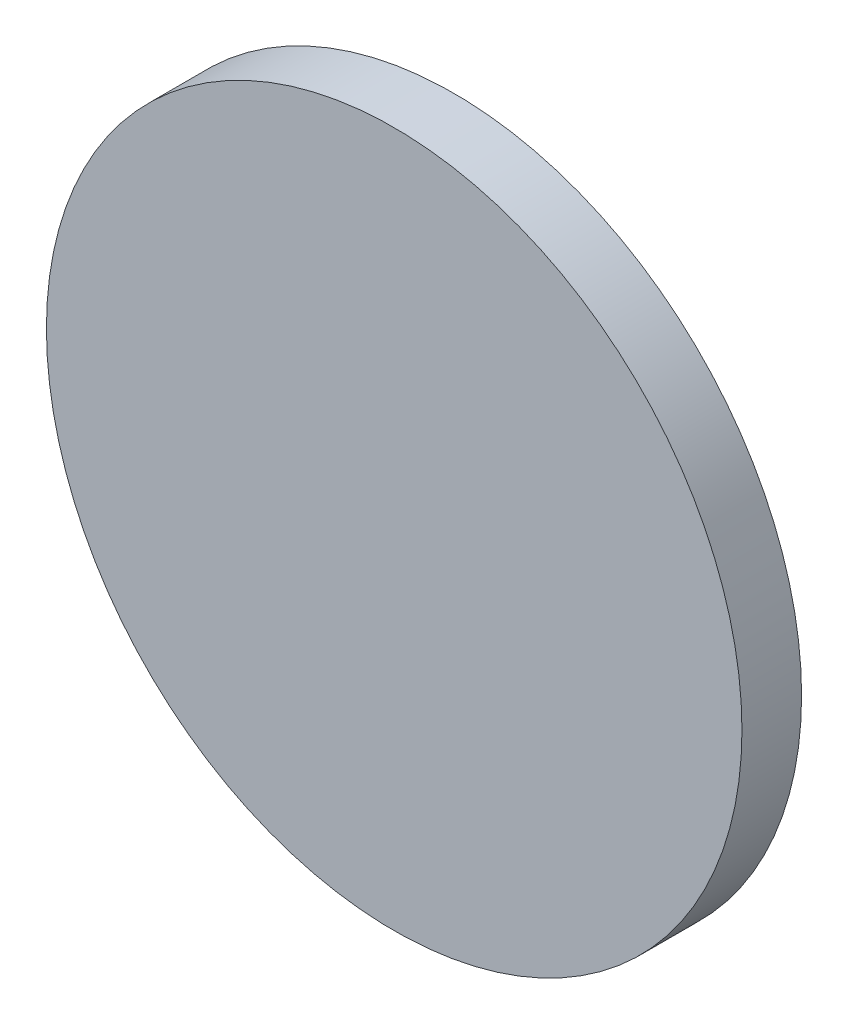
ISO-10303-21;
HEADER;
FILE_DESCRIPTION(('STEP AP214'),'2;1');
FILE_NAME('part.step','',(''),(''),'','','');
FILE_SCHEMA(('AUTOMOTIVE_DESIGN { 1 0 10303 214 1 1 1 1 }'));
ENDSEC;
DATA;
#1=APPLICATION_CONTEXT('core data for automotive mechanical design processes');
#2=APPLICATION_PROTOCOL_DEFINITION('international standard','automotive_design',2000,#1);
#3=PRODUCT_CONTEXT('',#1,'mechanical');
#4=PRODUCT('Part','Part','',(#3));
#5=PRODUCT_RELATED_PRODUCT_CATEGORY('part','',(#4));
#6=PRODUCT_DEFINITION_FORMATION('','',#4);
#7=PRODUCT_DEFINITION_CONTEXT('part definition',#1,'design');
#8=PRODUCT_DEFINITION('design','',#6,#7);
#9=PRODUCT_DEFINITION_SHAPE('','',#8);
#10=(LENGTH_UNIT() NAMED_UNIT(*) SI_UNIT(.MILLI.,.METRE.));
#11=(NAMED_UNIT(*) PLANE_ANGLE_UNIT() SI_UNIT($,.RADIAN.));
#12=(NAMED_UNIT(*) SI_UNIT($,.STERADIAN.) SOLID_ANGLE_UNIT());
#13=UNCERTAINTY_MEASURE_WITH_UNIT(LENGTH_MEASURE(1.E-05),#10,'distance_accuracy_value','');
#14=(GEOMETRIC_REPRESENTATION_CONTEXT(3) GLOBAL_UNCERTAINTY_ASSIGNED_CONTEXT((#13)) GLOBAL_UNIT_ASSIGNED_CONTEXT((#10,
#11,#12)) REPRESENTATION_CONTEXT('',''));
#15=CARTESIAN_POINT('',(0.,0.,0.));
#16=DIRECTION('',(0.,0.,1.));
#17=DIRECTION('',(1.,0.,0.));
#18=AXIS2_PLACEMENT_3D('',#15,#16,#17);
#19=CARTESIAN_POINT('',(7.325,9.375,0.76487));
#20=DIRECTION('',(0.,0.,-1.));
#21=DIRECTION('',(-1.,0.,0.));
#22=AXIS2_PLACEMENT_3D('',#19,#20,#21);
#23=PLANE('',#22);
#24=CARTESIAN_POINT('',(7.325,9.375,0.76487));
#25=DIRECTION('',(0.,0.,1.));
#26=DIRECTION('',(1.,0.,0.));
#27=AXIS2_PLACEMENT_3D('',#24,#25,#26);
#28=CIRCLE('',#27,0.200024667);
#29=CARTESIAN_POINT('',(7.525024667,9.375,0.76487));
#30=VERTEX_POINT('',#29);
#31=EDGE_CURVE('E18',#30,#30,#28,.T.);
#32=ORIENTED_EDGE('',*,*,#31,.F.);
#33=EDGE_LOOP('',(#32));
#34=FACE_BOUND('',#33,.T.);
#35=ADVANCED_FACE('F15',(#34),#23,.T.);
#36=CARTESIAN_POINT('',(7.325,9.375,0.76487));
#37=DIRECTION('',(0.,0.,1.));
#38=DIRECTION('',(1.,0.,0.));
#39=AXIS2_PLACEMENT_3D('',#36,#37,#38);
#40=CYLINDRICAL_SURFACE('',#39,0.200024667);
#41=CARTESIAN_POINT('',(7.325,9.375,0.79916));
#42=DIRECTION('',(0.,0.,1.));
#43=DIRECTION('',(1.,0.,0.));
#44=AXIS2_PLACEMENT_3D('',#41,#42,#43);
#45=CIRCLE('',#44,0.200024667);
#46=CARTESIAN_POINT('',(7.525024667,9.375,0.79916));
#47=VERTEX_POINT('',#46);
#48=EDGE_CURVE('E10',#47,#47,#45,.T.);
#49=ORIENTED_EDGE('',*,*,#48,.F.);
#50=EDGE_LOOP('',(#49));
#51=FACE_BOUND('',#50,.T.);
#52=ORIENTED_EDGE('',*,*,#31,.T.);
#53=EDGE_LOOP('',(#52));
#54=FACE_BOUND('',#53,.T.);
#55=ADVANCED_FACE('F27',(#51,#54),#40,.T.);
#56=CARTESIAN_POINT('',(7.325,9.375,0.79916));
#57=DIRECTION('',(0.,0.,1.));
#58=DIRECTION('',(1.,0.,0.));
#59=AXIS2_PLACEMENT_3D('',#56,#57,#58);
#60=PLANE('',#59);
#61=ORIENTED_EDGE('',*,*,#48,.T.);
#62=EDGE_LOOP('',(#61));
#63=FACE_BOUND('',#62,.T.);
#64=ADVANCED_FACE('F34',(#63),#60,.T.);
#65=CLOSED_SHELL('',(#35,#55,#64));
#66=MANIFOLD_SOLID_BREP('B1',#65);
#67=ADVANCED_BREP_SHAPE_REPRESENTATION('',(#18,#66),#14);
#68=SHAPE_DEFINITION_REPRESENTATION(#9,#67);
ENDSEC;
END-ISO-10303-21;
